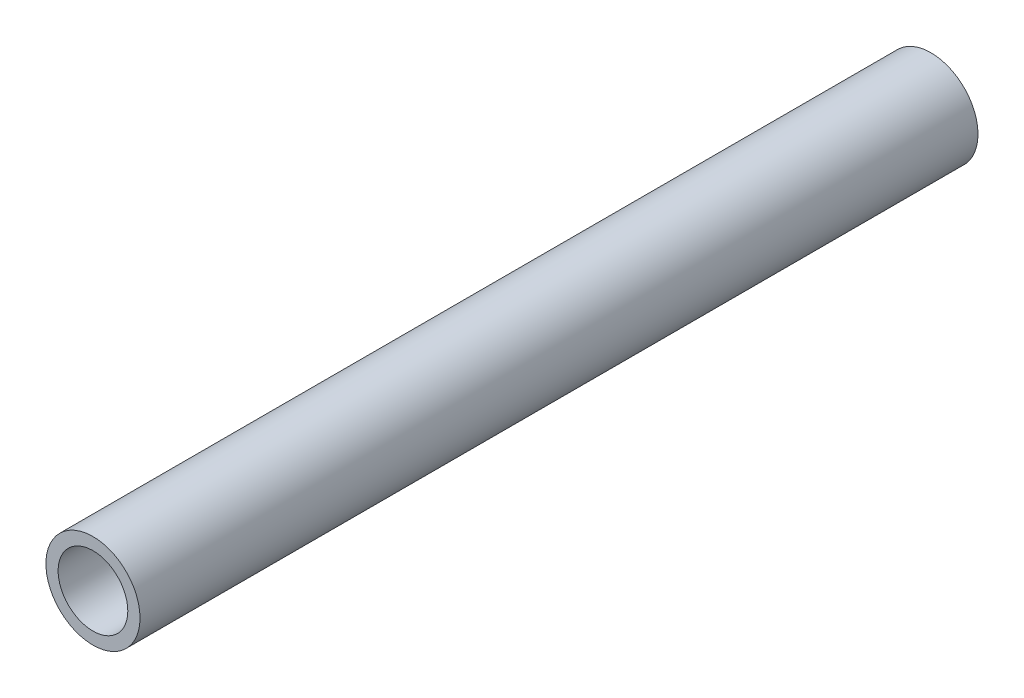
ISO-10303-21;
HEADER;
FILE_DESCRIPTION(('STEP AP214'),'2;1');
FILE_NAME('part.step','',(''),(''),'','','');
FILE_SCHEMA(('AUTOMOTIVE_DESIGN { 1 0 10303 214 1 1 1 1 }'));
ENDSEC;
DATA;
#1=APPLICATION_CONTEXT('core data for automotive mechanical design processes');
#2=APPLICATION_PROTOCOL_DEFINITION('international standard','automotive_design',2000,#1);
#3=PRODUCT_CONTEXT('',#1,'mechanical');
#4=PRODUCT('Part','Part','',(#3));
#5=PRODUCT_RELATED_PRODUCT_CATEGORY('part','',(#4));
#6=PRODUCT_DEFINITION_FORMATION('','',#4);
#7=PRODUCT_DEFINITION_CONTEXT('part definition',#1,'design');
#8=PRODUCT_DEFINITION('design','',#6,#7);
#9=PRODUCT_DEFINITION_SHAPE('','',#8);
#10=(LENGTH_UNIT() NAMED_UNIT(*) SI_UNIT(.MILLI.,.METRE.));
#11=(NAMED_UNIT(*) PLANE_ANGLE_UNIT() SI_UNIT($,.RADIAN.));
#12=(NAMED_UNIT(*) SI_UNIT($,.STERADIAN.) SOLID_ANGLE_UNIT());
#13=UNCERTAINTY_MEASURE_WITH_UNIT(LENGTH_MEASURE(1.E-05),#10,'distance_accuracy_value','');
#14=(GEOMETRIC_REPRESENTATION_CONTEXT(3) GLOBAL_UNCERTAINTY_ASSIGNED_CONTEXT((#13)) GLOBAL_UNIT_ASSIGNED_CONTEXT((#10,
#11,#12)) REPRESENTATION_CONTEXT('',''));
#15=CARTESIAN_POINT('',(0.,0.,0.));
#16=DIRECTION('',(0.,0.,1.));
#17=DIRECTION('',(1.,0.,0.));
#18=AXIS2_PLACEMENT_3D('',#15,#16,#17);
#19=CARTESIAN_POINT('',(0.,0.,95.));
#20=DIRECTION('',(0.,0.,1.));
#21=DIRECTION('',(1.,0.,0.));
#22=AXIS2_PLACEMENT_3D('',#19,#20,#21);
#23=PLANE('',#22);
#24=CARTESIAN_POINT('',(0.,0.,95.));
#25=DIRECTION('',(0.,0.,1.));
#26=DIRECTION('',(1.,0.,0.));
#27=AXIS2_PLACEMENT_3D('',#24,#25,#26);
#28=CIRCLE('',#27,10.668);
#29=CARTESIAN_POINT('',(10.668,0.,95.));
#30=VERTEX_POINT('',#29);
#31=EDGE_CURVE('E11',#30,#30,#28,.T.);
#32=ORIENTED_EDGE('',*,*,#31,.T.);
#33=EDGE_LOOP('',(#32));
#34=FACE_BOUND('',#33,.T.);
#35=CARTESIAN_POINT('',(0.,0.,95.));
#36=DIRECTION('',(0.,0.,1.));
#37=DIRECTION('',(1.,0.,0.));
#38=AXIS2_PLACEMENT_3D('',#35,#36,#37);
#39=CIRCLE('',#38,7.8994);
#40=CARTESIAN_POINT('',(7.8994,0.,95.));
#41=VERTEX_POINT('',#40);
#42=EDGE_CURVE('E50',#41,#41,#39,.T.);
#43=ORIENTED_EDGE('',*,*,#42,.F.);
#44=EDGE_LOOP('',(#43));
#45=FACE_BOUND('',#44,.T.);
#46=ADVANCED_FACE('F39',(#34,#45),#23,.T.);
#47=CARTESIAN_POINT('',(0.,0.,-95.));
#48=DIRECTION('',(0.,0.,1.));
#49=DIRECTION('',(1.,0.,0.));
#50=AXIS2_PLACEMENT_3D('',#47,#48,#49);
#51=PLANE('',#50);
#52=CARTESIAN_POINT('',(0.,0.,-95.));
#53=DIRECTION('',(0.,0.,1.));
#54=DIRECTION('',(1.,0.,0.));
#55=AXIS2_PLACEMENT_3D('',#52,#53,#54);
#56=CIRCLE('',#55,10.668);
#57=CARTESIAN_POINT('',(10.668,0.,-95.));
#58=VERTEX_POINT('',#57);
#59=EDGE_CURVE('E43',#58,#58,#56,.T.);
#60=ORIENTED_EDGE('',*,*,#59,.F.);
#61=EDGE_LOOP('',(#60));
#62=FACE_BOUND('',#61,.T.);
#63=CARTESIAN_POINT('',(0.,0.,-95.));
#64=DIRECTION('',(0.,0.,1.));
#65=DIRECTION('',(1.,0.,0.));
#66=AXIS2_PLACEMENT_3D('',#63,#64,#65);
#67=CIRCLE('',#66,7.8994);
#68=CARTESIAN_POINT('',(7.8994,0.,-95.));
#69=VERTEX_POINT('',#68);
#70=EDGE_CURVE('E52',#69,#69,#67,.T.);
#71=ORIENTED_EDGE('',*,*,#70,.T.);
#72=EDGE_LOOP('',(#71));
#73=FACE_BOUND('',#72,.T.);
#74=ADVANCED_FACE('F62',(#62,#73),#51,.F.);
#75=CARTESIAN_POINT('',(0.,0.,95.));
#76=DIRECTION('',(0.,0.,-1.));
#77=DIRECTION('',(-1.,0.,0.));
#78=AXIS2_PLACEMENT_3D('',#75,#76,#77);
#79=CYLINDRICAL_SURFACE('',#78,10.668);
#80=ORIENTED_EDGE('',*,*,#31,.F.);
#81=EDGE_LOOP('',(#80));
#82=FACE_BOUND('',#81,.T.);
#83=ORIENTED_EDGE('',*,*,#59,.T.);
#84=EDGE_LOOP('',(#83));
#85=FACE_BOUND('',#84,.T.);
#86=ADVANCED_FACE('F41',(#82,#85),#79,.T.);
#87=CARTESIAN_POINT('',(0.,0.,95.));
#88=DIRECTION('',(0.,0.,-1.));
#89=DIRECTION('',(-1.,0.,0.));
#90=AXIS2_PLACEMENT_3D('',#87,#88,#89);
#91=CYLINDRICAL_SURFACE('',#90,7.8994);
#92=ORIENTED_EDGE('',*,*,#42,.T.);
#93=EDGE_LOOP('',(#92));
#94=FACE_BOUND('',#93,.T.);
#95=ORIENTED_EDGE('',*,*,#70,.F.);
#96=EDGE_LOOP('',(#95));
#97=FACE_BOUND('',#96,.T.);
#98=ADVANCED_FACE('F58',(#94,#97),#91,.F.);
#99=CLOSED_SHELL('',(#46,#74,#86,#98));
#100=MANIFOLD_SOLID_BREP('B2',#99);
#101=ADVANCED_BREP_SHAPE_REPRESENTATION('',(#18,#100),#14);
#102=SHAPE_DEFINITION_REPRESENTATION(#9,#101);
ENDSEC;
END-ISO-10303-21;
